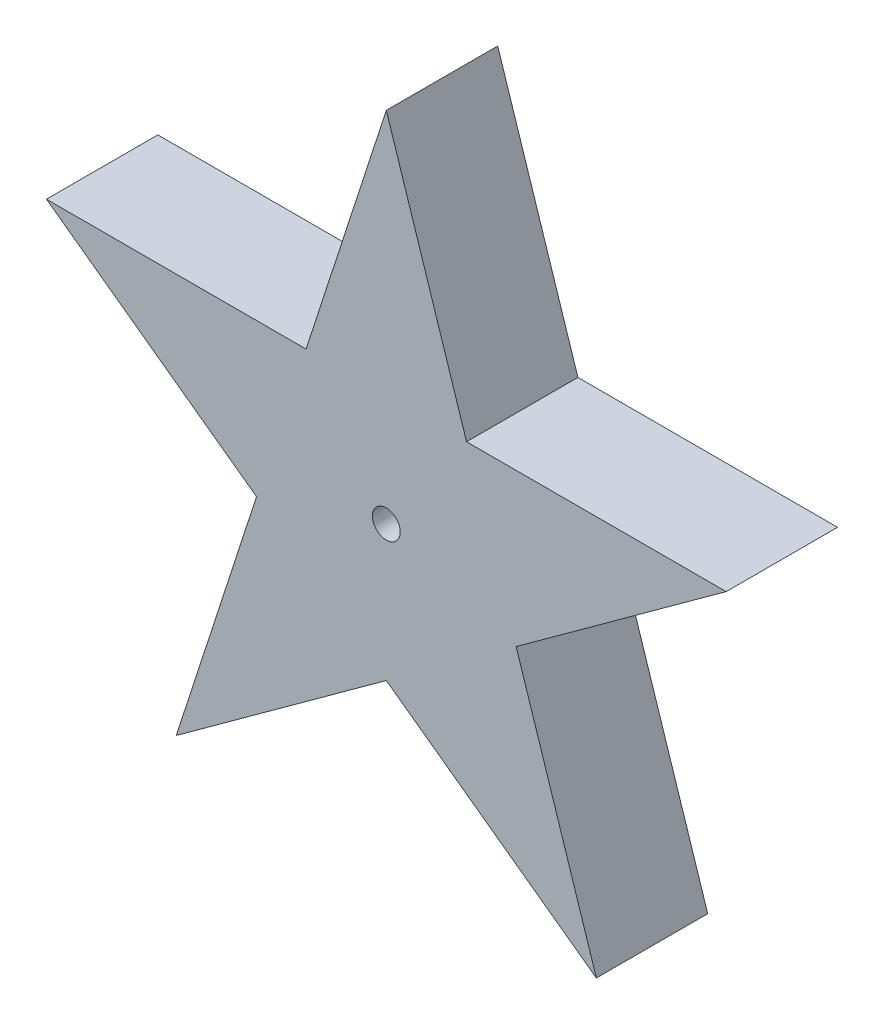
ISO-10303-21;
HEADER;
FILE_DESCRIPTION(('STEP AP214'),'2;1');
FILE_NAME('part.step','',(''),(''),'','','');
FILE_SCHEMA(('AUTOMOTIVE_DESIGN { 1 0 10303 214 1 1 1 1 }'));
ENDSEC;
DATA;
#1=APPLICATION_CONTEXT('core data for automotive mechanical design processes');
#2=APPLICATION_PROTOCOL_DEFINITION('international standard','automotive_design',2000,#1);
#3=PRODUCT_CONTEXT('',#1,'mechanical');
#4=PRODUCT('Part','Part','',(#3));
#5=PRODUCT_RELATED_PRODUCT_CATEGORY('part','',(#4));
#6=PRODUCT_DEFINITION_FORMATION('','',#4);
#7=PRODUCT_DEFINITION_CONTEXT('part definition',#1,'design');
#8=PRODUCT_DEFINITION('design','',#6,#7);
#9=PRODUCT_DEFINITION_SHAPE('','',#8);
#10=(LENGTH_UNIT() NAMED_UNIT(*) SI_UNIT(.MILLI.,.METRE.));
#11=(NAMED_UNIT(*) PLANE_ANGLE_UNIT() SI_UNIT($,.RADIAN.));
#12=(NAMED_UNIT(*) SI_UNIT($,.STERADIAN.) SOLID_ANGLE_UNIT());
#13=UNCERTAINTY_MEASURE_WITH_UNIT(LENGTH_MEASURE(1.E-05),#10,'distance_accuracy_value','');
#14=(GEOMETRIC_REPRESENTATION_CONTEXT(3) GLOBAL_UNCERTAINTY_ASSIGNED_CONTEXT((#13)) GLOBAL_UNIT_ASSIGNED_CONTEXT((#10,
#11,#12)) REPRESENTATION_CONTEXT('',''));
#15=CARTESIAN_POINT('',(0.,0.,0.));
#16=DIRECTION('',(0.,0.,1.));
#17=DIRECTION('',(1.,0.,0.));
#18=AXIS2_PLACEMENT_3D('',#15,#16,#17);
#19=CARTESIAN_POINT('',(-0.720420954555112,1.,1.));
#20=DIRECTION('',(0.951056516295154,-0.309016994374945,0.));
#21=DIRECTION('',(0.309016994374945,0.951056516295155,0.));
#22=AXIS2_PLACEMENT_3D('',#19,#20,#21);
#23=PLANE('',#22);
#24=DIRECTION('',(-0.309016994374945,-0.951056516295155,0.));
#25=VECTOR('',#24,1.);
#26=CARTESIAN_POINT('',(-0.720420954555112,1.,0.));
#27=LINE('',#26,#25);
#28=CARTESIAN_POINT('',(0.,3.21722771167037,0.));
#29=VERTEX_POINT('',#28);
#30=CARTESIAN_POINT('',(-0.720420954555112,1.,0.));
#31=VERTEX_POINT('',#30);
#32=EDGE_CURVE('E142',#29,#31,#27,.T.);
#33=ORIENTED_EDGE('',*,*,#32,.T.);
#34=DIRECTION('',(0.,0.,-1.));
#35=VECTOR('',#34,1.);
#36=CARTESIAN_POINT('',(-0.720420954555112,1.,1.));
#37=LINE('',#36,#35);
#38=CARTESIAN_POINT('',(-0.720420954555112,1.,1.));
#39=VERTEX_POINT('',#38);
#40=EDGE_CURVE('E11',#39,#31,#37,.T.);
#41=ORIENTED_EDGE('',*,*,#40,.F.);
#42=DIRECTION('',(-0.309016994374945,-0.951056516295155,0.));
#43=VECTOR('',#42,1.);
#44=CARTESIAN_POINT('',(-0.720420954555112,1.,1.));
#45=LINE('',#44,#43);
#46=CARTESIAN_POINT('',(0.,3.21722771167037,1.));
#47=VERTEX_POINT('',#46);
#48=EDGE_CURVE('E161',#47,#39,#45,.T.);
#49=ORIENTED_EDGE('',*,*,#48,.F.);
#50=DIRECTION('',(0.,0.,-1.));
#51=VECTOR('',#50,1.);
#52=CARTESIAN_POINT('',(0.,3.21722771167037,1.));
#53=LINE('',#52,#51);
#54=EDGE_CURVE('E138',#47,#29,#53,.T.);
#55=ORIENTED_EDGE('',*,*,#54,.T.);
#56=EDGE_LOOP('',(#33,#41,#49,#55));
#57=FACE_BOUND('',#56,.T.);
#58=ADVANCED_FACE('F34',(#57),#23,.F.);
#59=CARTESIAN_POINT('',(-3.05175213591072,1.,1.));
#60=DIRECTION('',(0.,-1.,0.));
#61=DIRECTION('',(1.,0.,0.));
#62=AXIS2_PLACEMENT_3D('',#59,#60,#61);
#63=PLANE('',#62);
#64=DIRECTION('',(-1.,0.,0.));
#65=VECTOR('',#64,1.);
#66=CARTESIAN_POINT('',(-3.05175213591072,1.,0.));
#67=LINE('',#66,#65);
#68=CARTESIAN_POINT('',(-3.05175213591072,1.,0.));
#69=VERTEX_POINT('',#68);
#70=EDGE_CURVE('E145',#31,#69,#67,.T.);
#71=ORIENTED_EDGE('',*,*,#70,.T.);
#72=DIRECTION('',(0.,0.,-1.));
#73=VECTOR('',#72,1.);
#74=CARTESIAN_POINT('',(-3.05175213591072,1.,1.));
#75=LINE('',#74,#73);
#76=CARTESIAN_POINT('',(-3.05175213591072,1.,1.));
#77=VERTEX_POINT('',#76);
#78=EDGE_CURVE('E42',#77,#69,#75,.T.);
#79=ORIENTED_EDGE('',*,*,#78,.F.);
#80=DIRECTION('',(-1.,0.,0.));
#81=VECTOR('',#80,1.);
#82=CARTESIAN_POINT('',(-3.05175213591072,1.,1.));
#83=LINE('',#82,#81);
#84=EDGE_CURVE('E99',#39,#77,#83,.T.);
#85=ORIENTED_EDGE('',*,*,#84,.F.);
#86=ORIENTED_EDGE('',*,*,#40,.T.);
#87=EDGE_LOOP('',(#71,#79,#85,#86));
#88=FACE_BOUND('',#87,.T.);
#89=ADVANCED_FACE('F231',(#88),#63,.F.);
#90=CARTESIAN_POINT('',(-1.16566559067781,-0.370322086610429,1.));
#91=DIRECTION('',(0.587785252292476,0.809016994374945,0.));
#92=DIRECTION('',(-0.809016994374945,0.587785252292476,0.));
#93=AXIS2_PLACEMENT_3D('',#90,#91,#92);
#94=PLANE('',#93);
#95=DIRECTION('',(0.809016994374945,-0.587785252292476,0.));
#96=VECTOR('',#95,1.);
#97=CARTESIAN_POINT('',(-1.16566559067781,-0.370322086610429,0.));
#98=LINE('',#97,#96);
#99=CARTESIAN_POINT('',(-1.16566559067781,-0.370322086610429,0.));
#100=VERTEX_POINT('',#99);
#101=EDGE_CURVE('E148',#69,#100,#98,.T.);
#102=ORIENTED_EDGE('',*,*,#101,.T.);
#103=DIRECTION('',(0.,0.,-1.));
#104=VECTOR('',#103,1.);
#105=CARTESIAN_POINT('',(-1.16566559067781,-0.370322086610429,1.));
#106=LINE('',#105,#104);
#107=CARTESIAN_POINT('',(-1.16566559067781,-0.370322086610429,1.));
#108=VERTEX_POINT('',#107);
#109=EDGE_CURVE('E174',#108,#100,#106,.T.);
#110=ORIENTED_EDGE('',*,*,#109,.F.);
#111=DIRECTION('',(0.809016994374945,-0.587785252292476,0.));
#112=VECTOR('',#111,1.);
#113=CARTESIAN_POINT('',(-1.16566559067781,-0.370322086610429,1.));
#114=LINE('',#113,#112);
#115=EDGE_CURVE('E182',#77,#108,#114,.T.);
#116=ORIENTED_EDGE('',*,*,#115,.F.);
#117=ORIENTED_EDGE('',*,*,#78,.T.);
#118=EDGE_LOOP('',(#102,#110,#116,#117));
#119=FACE_BOUND('',#118,.T.);
#120=ADVANCED_FACE('F180',(#119),#94,.F.);
#121=CARTESIAN_POINT('',(-1.88608654523292,-2.58754979828079,1.));
#122=DIRECTION('',(0.951056516295155,-0.309016994374945,0.));
#123=DIRECTION('',(0.309016994374945,0.951056516295155,0.));
#124=AXIS2_PLACEMENT_3D('',#121,#122,#123);
#125=PLANE('',#124);
#126=DIRECTION('',(-0.309016994374945,-0.951056516295155,0.));
#127=VECTOR('',#126,1.);
#128=CARTESIAN_POINT('',(-1.88608654523292,-2.58754979828079,0.));
#129=LINE('',#128,#127);
#130=CARTESIAN_POINT('',(-1.88608654523292,-2.58754979828079,0.));
#131=VERTEX_POINT('',#130);
#132=EDGE_CURVE('E150',#100,#131,#129,.T.);
#133=ORIENTED_EDGE('',*,*,#132,.T.);
#134=DIRECTION('',(0.,0.,-1.));
#135=VECTOR('',#134,1.);
#136=CARTESIAN_POINT('',(-1.88608654523292,-2.58754979828079,1.));
#137=LINE('',#136,#135);
#138=CARTESIAN_POINT('',(-1.88608654523292,-2.58754979828079,1.));
#139=VERTEX_POINT('',#138);
#140=EDGE_CURVE('E171',#139,#131,#137,.T.);
#141=ORIENTED_EDGE('',*,*,#140,.F.);
#142=DIRECTION('',(-0.309016994374945,-0.951056516295155,0.));
#143=VECTOR('',#142,1.);
#144=CARTESIAN_POINT('',(-1.88608654523292,-2.58754979828079,1.));
#145=LINE('',#144,#143);
#146=EDGE_CURVE('E200',#108,#139,#145,.T.);
#147=ORIENTED_EDGE('',*,*,#146,.F.);
#148=ORIENTED_EDGE('',*,*,#109,.T.);
#149=EDGE_LOOP('',(#133,#141,#147,#148));
#150=FACE_BOUND('',#149,.T.);
#151=ADVANCED_FACE('F191',(#150),#125,.F.);
#152=CARTESIAN_POINT('',(0.,-1.21722771167035,1.));
#153=DIRECTION('',(-0.587785252292477,0.809016994374945,0.));
#154=DIRECTION('',(-0.809016994374945,-0.587785252292477,0.));
#155=AXIS2_PLACEMENT_3D('',#152,#153,#154);
#156=PLANE('',#155);
#157=DIRECTION('',(0.809016994374945,0.587785252292477,0.));
#158=VECTOR('',#157,1.);
#159=CARTESIAN_POINT('',(0.,-1.21722771167035,0.));
#160=LINE('',#159,#158);
#161=CARTESIAN_POINT('',(0.,-1.21722771167035,0.));
#162=VERTEX_POINT('',#161);
#163=EDGE_CURVE('E152',#131,#162,#160,.T.);
#164=ORIENTED_EDGE('',*,*,#163,.T.);
#165=DIRECTION('',(0.,0.,-1.));
#166=VECTOR('',#165,1.);
#167=CARTESIAN_POINT('',(0.,-1.21722771167035,1.));
#168=LINE('',#167,#166);
#169=CARTESIAN_POINT('',(0.,-1.21722771167035,1.));
#170=VERTEX_POINT('',#169);
#171=EDGE_CURVE('E168',#170,#162,#168,.T.);
#172=ORIENTED_EDGE('',*,*,#171,.F.);
#173=DIRECTION('',(0.809016994374945,0.587785252292477,0.));
#174=VECTOR('',#173,1.);
#175=CARTESIAN_POINT('',(0.,-1.21722771167035,1.));
#176=LINE('',#175,#174);
#177=EDGE_CURVE('E197',#139,#170,#176,.T.);
#178=ORIENTED_EDGE('',*,*,#177,.F.);
#179=ORIENTED_EDGE('',*,*,#140,.T.);
#180=EDGE_LOOP('',(#164,#172,#178,#179));
#181=FACE_BOUND('',#180,.T.);
#182=ADVANCED_FACE('F195',(#181),#156,.F.);
#183=CARTESIAN_POINT('',(1.88608654523292,-2.58754979828079,1.));
#184=DIRECTION('',(0.587785252292476,0.809016994374945,0.));
#185=DIRECTION('',(-0.809016994374945,0.587785252292476,0.));
#186=AXIS2_PLACEMENT_3D('',#183,#184,#185);
#187=PLANE('',#186);
#188=DIRECTION('',(0.809016994374945,-0.587785252292476,0.));
#189=VECTOR('',#188,1.);
#190=CARTESIAN_POINT('',(1.88608654523292,-2.58754979828079,0.));
#191=LINE('',#190,#189);
#192=CARTESIAN_POINT('',(1.88608654523292,-2.58754979828079,0.));
#193=VERTEX_POINT('',#192);
#194=EDGE_CURVE('E154',#162,#193,#191,.T.);
#195=ORIENTED_EDGE('',*,*,#194,.T.);
#196=DIRECTION('',(0.,0.,-1.));
#197=VECTOR('',#196,1.);
#198=CARTESIAN_POINT('',(1.88608654523292,-2.58754979828079,1.));
#199=LINE('',#198,#197);
#200=CARTESIAN_POINT('',(1.88608654523292,-2.58754979828079,1.));
#201=VERTEX_POINT('',#200);
#202=EDGE_CURVE('E165',#201,#193,#199,.T.);
#203=ORIENTED_EDGE('',*,*,#202,.F.);
#204=DIRECTION('',(0.809016994374945,-0.587785252292476,0.));
#205=VECTOR('',#204,1.);
#206=CARTESIAN_POINT('',(1.88608654523292,-2.58754979828079,1.));
#207=LINE('',#206,#205);
#208=EDGE_CURVE('E199',#170,#201,#207,.T.);
#209=ORIENTED_EDGE('',*,*,#208,.F.);
#210=ORIENTED_EDGE('',*,*,#171,.T.);
#211=EDGE_LOOP('',(#195,#203,#209,#210));
#212=FACE_BOUND('',#211,.T.);
#213=ADVANCED_FACE('F243',(#212),#187,.F.);
#214=CARTESIAN_POINT('',(1.16566559067781,-0.370322086610428,1.));
#215=DIRECTION('',(-0.951056516295154,-0.309016994374945,0.));
#216=DIRECTION('',(0.309016994374945,-0.951056516295154,0.));
#217=AXIS2_PLACEMENT_3D('',#214,#215,#216);
#218=PLANE('',#217);
#219=DIRECTION('',(-0.309016994374945,0.951056516295154,0.));
#220=VECTOR('',#219,1.);
#221=CARTESIAN_POINT('',(1.16566559067781,-0.370322086610428,0.));
#222=LINE('',#221,#220);
#223=CARTESIAN_POINT('',(1.16566559067781,-0.370322086610428,0.));
#224=VERTEX_POINT('',#223);
#225=EDGE_CURVE('E156',#193,#224,#222,.T.);
#226=ORIENTED_EDGE('',*,*,#225,.T.);
#227=DIRECTION('',(0.,0.,-1.));
#228=VECTOR('',#227,1.);
#229=CARTESIAN_POINT('',(1.16566559067781,-0.370322086610428,1.));
#230=LINE('',#229,#228);
#231=CARTESIAN_POINT('',(1.16566559067781,-0.370322086610428,1.));
#232=VERTEX_POINT('',#231);
#233=EDGE_CURVE('E133',#232,#224,#230,.T.);
#234=ORIENTED_EDGE('',*,*,#233,.F.);
#235=DIRECTION('',(-0.309016994374945,0.951056516295154,0.));
#236=VECTOR('',#235,1.);
#237=CARTESIAN_POINT('',(1.16566559067781,-0.370322086610428,1.));
#238=LINE('',#237,#236);
#239=EDGE_CURVE('E124',#201,#232,#238,.T.);
#240=ORIENTED_EDGE('',*,*,#239,.F.);
#241=ORIENTED_EDGE('',*,*,#202,.T.);
#242=EDGE_LOOP('',(#226,#234,#240,#241));
#243=FACE_BOUND('',#242,.T.);
#244=ADVANCED_FACE('F240',(#243),#218,.F.);
#245=CARTESIAN_POINT('',(3.05175213591072,1.,1.));
#246=DIRECTION('',(-0.587785252292477,0.809016994374945,0.));
#247=DIRECTION('',(-0.809016994374945,-0.587785252292477,0.));
#248=AXIS2_PLACEMENT_3D('',#245,#246,#247);
#249=PLANE('',#248);
#250=DIRECTION('',(0.809016994374945,0.587785252292477,0.));
#251=VECTOR('',#250,1.);
#252=CARTESIAN_POINT('',(3.05175213591072,1.,0.));
#253=LINE('',#252,#251);
#254=CARTESIAN_POINT('',(3.05175213591072,1.,0.));
#255=VERTEX_POINT('',#254);
#256=EDGE_CURVE('E132',#224,#255,#253,.T.);
#257=ORIENTED_EDGE('',*,*,#256,.T.);
#258=DIRECTION('',(0.,0.,-1.));
#259=VECTOR('',#258,1.);
#260=CARTESIAN_POINT('',(3.05175213591072,1.,1.));
#261=LINE('',#260,#259);
#262=CARTESIAN_POINT('',(3.05175213591072,1.,1.));
#263=VERTEX_POINT('',#262);
#264=EDGE_CURVE('E129',#263,#255,#261,.T.);
#265=ORIENTED_EDGE('',*,*,#264,.F.);
#266=DIRECTION('',(0.809016994374945,0.587785252292477,0.));
#267=VECTOR('',#266,1.);
#268=CARTESIAN_POINT('',(3.05175213591072,1.,1.));
#269=LINE('',#268,#267);
#270=EDGE_CURVE('E118',#232,#263,#269,.T.);
#271=ORIENTED_EDGE('',*,*,#270,.F.);
#272=ORIENTED_EDGE('',*,*,#233,.T.);
#273=EDGE_LOOP('',(#257,#265,#271,#272));
#274=FACE_BOUND('',#273,.T.);
#275=ADVANCED_FACE('F130',(#274),#249,.F.);
#276=CARTESIAN_POINT('',(0.720420954555112,1.,1.));
#277=DIRECTION('',(0.,-1.,0.));
#278=DIRECTION('',(1.,0.,0.));
#279=AXIS2_PLACEMENT_3D('',#276,#277,#278);
#280=PLANE('',#279);
#281=DIRECTION('',(-1.,0.,0.));
#282=VECTOR('',#281,1.);
#283=CARTESIAN_POINT('',(0.720420954555112,1.,0.));
#284=LINE('',#283,#282);
#285=CARTESIAN_POINT('',(0.720420954555112,1.,0.));
#286=VERTEX_POINT('',#285);
#287=EDGE_CURVE('E85',#255,#286,#284,.T.);
#288=ORIENTED_EDGE('',*,*,#287,.T.);
#289=DIRECTION('',(0.,0.,-1.));
#290=VECTOR('',#289,1.);
#291=CARTESIAN_POINT('',(0.720420954555112,1.,1.));
#292=LINE('',#291,#290);
#293=CARTESIAN_POINT('',(0.720420954555112,1.,1.));
#294=VERTEX_POINT('',#293);
#295=EDGE_CURVE('E134',#294,#286,#292,.T.);
#296=ORIENTED_EDGE('',*,*,#295,.F.);
#297=DIRECTION('',(-1.,0.,0.));
#298=VECTOR('',#297,1.);
#299=CARTESIAN_POINT('',(0.720420954555112,1.,1.));
#300=LINE('',#299,#298);
#301=EDGE_CURVE('E122',#263,#294,#300,.T.);
#302=ORIENTED_EDGE('',*,*,#301,.F.);
#303=ORIENTED_EDGE('',*,*,#264,.T.);
#304=EDGE_LOOP('',(#288,#296,#302,#303));
#305=FACE_BOUND('',#304,.T.);
#306=ADVANCED_FACE('F136',(#305),#280,.F.);
#307=CARTESIAN_POINT('',(0.,3.21722771167037,1.));
#308=DIRECTION('',(-0.951056516295154,-0.309016994374945,0.));
#309=DIRECTION('',(0.309016994374945,-0.951056516295154,0.));
#310=AXIS2_PLACEMENT_3D('',#307,#308,#309);
#311=PLANE('',#310);
#312=DIRECTION('',(-0.309016994374945,0.951056516295154,0.));
#313=VECTOR('',#312,1.);
#314=CARTESIAN_POINT('',(0.,3.21722771167037,0.));
#315=LINE('',#314,#313);
#316=EDGE_CURVE('E91',#286,#29,#315,.T.);
#317=ORIENTED_EDGE('',*,*,#316,.T.);
#318=ORIENTED_EDGE('',*,*,#54,.F.);
#319=DIRECTION('',(-0.309016994374945,0.951056516295154,0.));
#320=VECTOR('',#319,1.);
#321=CARTESIAN_POINT('',(0.,3.21722771167037,1.));
#322=LINE('',#321,#320);
#323=EDGE_CURVE('E50',#294,#47,#322,.T.);
#324=ORIENTED_EDGE('',*,*,#323,.F.);
#325=ORIENTED_EDGE('',*,*,#295,.T.);
#326=EDGE_LOOP('',(#317,#318,#324,#325));
#327=FACE_BOUND('',#326,.T.);
#328=ADVANCED_FACE('F227',(#327),#311,.F.);
#329=CARTESIAN_POINT('',(0.,0.,1.));
#330=DIRECTION('',(0.,0.,-1.));
#331=DIRECTION('',(-1.,0.,0.));
#332=AXIS2_PLACEMENT_3D('',#329,#330,#331);
#333=PLANE('',#332);
#334=CARTESIAN_POINT('',(0.,0.,1.));
#335=DIRECTION('',(0.,0.,-1.));
#336=DIRECTION('',(-1.,0.,0.));
#337=AXIS2_PLACEMENT_3D('',#334,#335,#336);
#338=CIRCLE('',#337,0.125);
#339=CARTESIAN_POINT('',(-0.125,0.,1.));
#340=VERTEX_POINT('',#339);
#341=EDGE_CURVE('E146',#340,#340,#338,.T.);
#342=ORIENTED_EDGE('',*,*,#341,.T.);
#343=EDGE_LOOP('',(#342));
#344=FACE_BOUND('',#343,.T.);
#345=ORIENTED_EDGE('',*,*,#48,.T.);
#346=ORIENTED_EDGE('',*,*,#84,.T.);
#347=ORIENTED_EDGE('',*,*,#115,.T.);
#348=ORIENTED_EDGE('',*,*,#146,.T.);
#349=ORIENTED_EDGE('',*,*,#177,.T.);
#350=ORIENTED_EDGE('',*,*,#208,.T.);
#351=ORIENTED_EDGE('',*,*,#239,.T.);
#352=ORIENTED_EDGE('',*,*,#270,.T.);
#353=ORIENTED_EDGE('',*,*,#301,.T.);
#354=ORIENTED_EDGE('',*,*,#323,.T.);
#355=EDGE_LOOP('',(#345,#346,#347,#348,#349,#350,#351,#352,#353,#354));
#356=FACE_BOUND('',#355,.T.);
#357=ADVANCED_FACE('F120',(#344,#356),#333,.F.);
#358=CARTESIAN_POINT('',(0.,0.,0.));
#359=DIRECTION('',(0.,0.,-1.));
#360=DIRECTION('',(-1.,0.,0.));
#361=AXIS2_PLACEMENT_3D('',#358,#359,#360);
#362=PLANE('',#361);
#363=CARTESIAN_POINT('',(0.,0.,0.));
#364=DIRECTION('',(0.,0.,-1.));
#365=DIRECTION('',(-1.,0.,0.));
#366=AXIS2_PLACEMENT_3D('',#363,#364,#365);
#367=CIRCLE('',#366,0.125);
#368=CARTESIAN_POINT('',(-0.125,0.,0.));
#369=VERTEX_POINT('',#368);
#370=EDGE_CURVE('E208',#369,#369,#367,.T.);
#371=ORIENTED_EDGE('',*,*,#370,.F.);
#372=EDGE_LOOP('',(#371));
#373=FACE_BOUND('',#372,.T.);
#374=ORIENTED_EDGE('',*,*,#32,.F.);
#375=ORIENTED_EDGE('',*,*,#316,.F.);
#376=ORIENTED_EDGE('',*,*,#287,.F.);
#377=ORIENTED_EDGE('',*,*,#256,.F.);
#378=ORIENTED_EDGE('',*,*,#225,.F.);
#379=ORIENTED_EDGE('',*,*,#194,.F.);
#380=ORIENTED_EDGE('',*,*,#163,.F.);
#381=ORIENTED_EDGE('',*,*,#132,.F.);
#382=ORIENTED_EDGE('',*,*,#101,.F.);
#383=ORIENTED_EDGE('',*,*,#70,.F.);
#384=EDGE_LOOP('',(#374,#375,#376,#377,#378,#379,#380,#381,#382,#383));
#385=FACE_BOUND('',#384,.T.);
#386=ADVANCED_FACE('F186',(#373,#385),#362,.T.);
#387=CARTESIAN_POINT('',(0.,0.,1.));
#388=DIRECTION('',(0.,0.,-1.));
#389=DIRECTION('',(-1.,0.,0.));
#390=AXIS2_PLACEMENT_3D('',#387,#388,#389);
#391=CYLINDRICAL_SURFACE('',#390,0.125);
#392=ORIENTED_EDGE('',*,*,#341,.F.);
#393=EDGE_LOOP('',(#392));
#394=FACE_BOUND('',#393,.T.);
#395=ORIENTED_EDGE('',*,*,#370,.T.);
#396=EDGE_LOOP('',(#395));
#397=FACE_BOUND('',#396,.T.);
#398=ADVANCED_FACE('F215',(#394,#397),#391,.F.);
#399=CLOSED_SHELL('',(#58,#89,#120,#151,#182,#213,#244,#275,#306,#328,#357,#386,#398));
#400=MANIFOLD_SOLID_BREP('B2',#399);
#401=ADVANCED_BREP_SHAPE_REPRESENTATION('',(#18,#400),#14);
#402=SHAPE_DEFINITION_REPRESENTATION(#9,#401);
ENDSEC;
END-ISO-10303-21;
